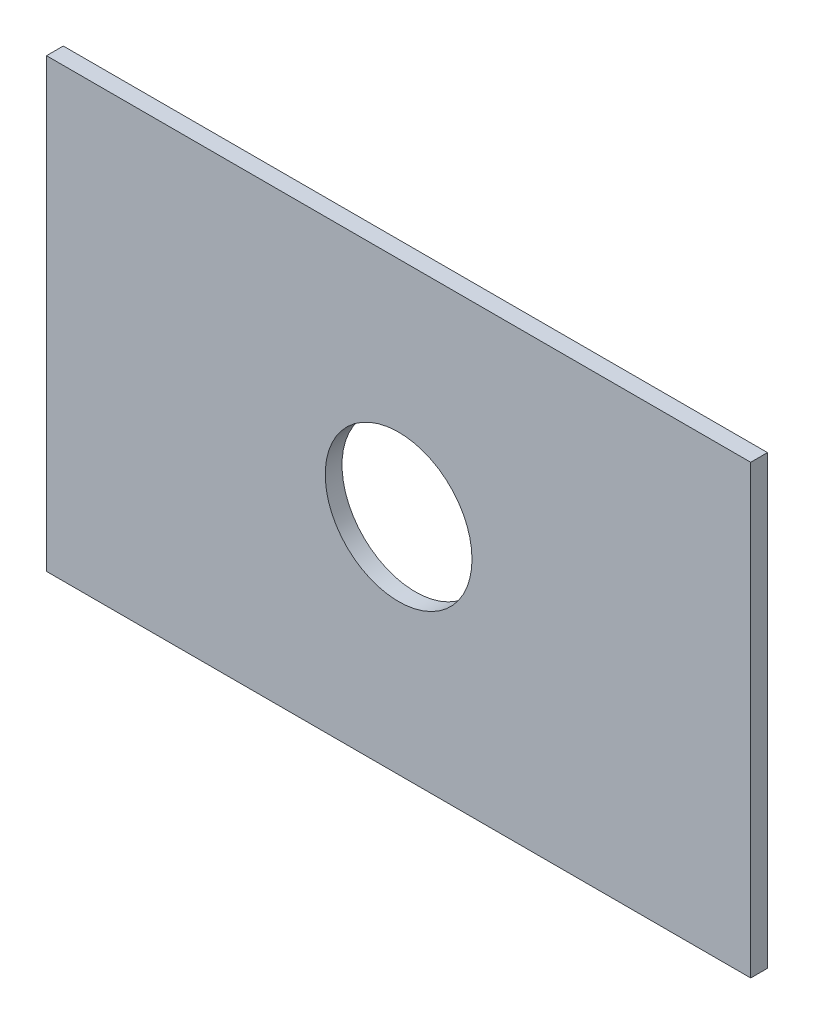
ISO-10303-21;
HEADER;
FILE_DESCRIPTION(('STEP AP214'),'2;1');
FILE_NAME('part.step','',(''),(''),'','','');
FILE_SCHEMA(('AUTOMOTIVE_DESIGN { 1 0 10303 214 1 1 1 1 }'));
ENDSEC;
DATA;
#1=APPLICATION_CONTEXT('core data for automotive mechanical design processes');
#2=APPLICATION_PROTOCOL_DEFINITION('international standard','automotive_design',2000,#1);
#3=PRODUCT_CONTEXT('',#1,'mechanical');
#4=PRODUCT('Part','Part','',(#3));
#5=PRODUCT_RELATED_PRODUCT_CATEGORY('part','',(#4));
#6=PRODUCT_DEFINITION_FORMATION('','',#4);
#7=PRODUCT_DEFINITION_CONTEXT('part definition',#1,'design');
#8=PRODUCT_DEFINITION('design','',#6,#7);
#9=PRODUCT_DEFINITION_SHAPE('','',#8);
#10=(LENGTH_UNIT() NAMED_UNIT(*) SI_UNIT(.MILLI.,.METRE.));
#11=(NAMED_UNIT(*) PLANE_ANGLE_UNIT() SI_UNIT($,.RADIAN.));
#12=(NAMED_UNIT(*) SI_UNIT($,.STERADIAN.) SOLID_ANGLE_UNIT());
#13=UNCERTAINTY_MEASURE_WITH_UNIT(LENGTH_MEASURE(1.E-05),#10,'distance_accuracy_value','');
#14=(GEOMETRIC_REPRESENTATION_CONTEXT(3) GLOBAL_UNCERTAINTY_ASSIGNED_CONTEXT((#13)) GLOBAL_UNIT_ASSIGNED_CONTEXT((#10,
#11,#12)) REPRESENTATION_CONTEXT('',''));
#15=CARTESIAN_POINT('',(0.,0.,0.));
#16=DIRECTION('',(0.,0.,1.));
#17=DIRECTION('',(1.,0.,0.));
#18=AXIS2_PLACEMENT_3D('',#15,#16,#17);
#19=CARTESIAN_POINT('',(0.,0.,2.54));
#20=DIRECTION('',(0.,0.,-1.));
#21=DIRECTION('',(-1.,0.,0.));
#22=AXIS2_PLACEMENT_3D('',#19,#20,#21);
#23=PLANE('',#22);
#24=DIRECTION('',(0.,1.,0.));
#25=VECTOR('',#24,1.);
#26=CARTESIAN_POINT('',(53.3136112878186,-33.8131219822322,2.54));
#27=LINE('',#26,#25);
#28=CARTESIAN_POINT('',(53.3136112878186,-33.8131219822322,2.54));
#29=VERTEX_POINT('',#28);
#30=CARTESIAN_POINT('',(53.3136112878186,33.8131219822322,2.54));
#31=VERTEX_POINT('',#30);
#32=EDGE_CURVE('E92',#29,#31,#27,.T.);
#33=ORIENTED_EDGE('',*,*,#32,.T.);
#34=DIRECTION('',(-1.,0.,0.));
#35=VECTOR('',#34,1.);
#36=CARTESIAN_POINT('',(-53.3136112878186,33.8131219822322,2.54));
#37=LINE('',#36,#35);
#38=CARTESIAN_POINT('',(-53.3136112878186,33.8131219822322,2.54));
#39=VERTEX_POINT('',#38);
#40=EDGE_CURVE('E87',#31,#39,#37,.T.);
#41=ORIENTED_EDGE('',*,*,#40,.T.);
#42=DIRECTION('',(0.,-1.,0.));
#43=VECTOR('',#42,1.);
#44=CARTESIAN_POINT('',(-53.3136112878186,-33.8131219822322,2.54));
#45=LINE('',#44,#43);
#46=CARTESIAN_POINT('',(-53.3136112878186,-33.8131219822322,2.54));
#47=VERTEX_POINT('',#46);
#48=EDGE_CURVE('E90',#39,#47,#45,.T.);
#49=ORIENTED_EDGE('',*,*,#48,.T.);
#50=DIRECTION('',(1.,0.,0.));
#51=VECTOR('',#50,1.);
#52=CARTESIAN_POINT('',(-53.3136112878186,-33.8131219822322,2.54));
#53=LINE('',#52,#51);
#54=EDGE_CURVE('E57',#47,#29,#53,.T.);
#55=ORIENTED_EDGE('',*,*,#54,.T.);
#56=EDGE_LOOP('',(#33,#41,#49,#55));
#57=FACE_BOUND('',#56,.T.);
#58=CARTESIAN_POINT('',(0.,0.,2.54));
#59=DIRECTION('',(0.,0.,1.));
#60=DIRECTION('',(1.,0.,0.));
#61=AXIS2_PLACEMENT_3D('',#58,#59,#60);
#62=CIRCLE('',#61,11.1125);
#63=CARTESIAN_POINT('',(11.1125,0.,2.54));
#64=VERTEX_POINT('',#63);
#65=EDGE_CURVE('E112',#64,#64,#62,.T.);
#66=ORIENTED_EDGE('',*,*,#65,.F.);
#67=EDGE_LOOP('',(#66));
#68=FACE_BOUND('',#67,.T.);
#69=ADVANCED_FACE('F39',(#57,#68),#23,.F.);
#70=CARTESIAN_POINT('',(0.,0.,0.));
#71=DIRECTION('',(0.,0.,-1.));
#72=DIRECTION('',(-1.,0.,0.));
#73=AXIS2_PLACEMENT_3D('',#70,#71,#72);
#74=PLANE('',#73);
#75=DIRECTION('',(0.,1.,0.));
#76=VECTOR('',#75,1.);
#77=CARTESIAN_POINT('',(53.3136112878186,-33.8131219822322,0.));
#78=LINE('',#77,#76);
#79=CARTESIAN_POINT('',(53.3136112878186,-33.8131219822322,0.));
#80=VERTEX_POINT('',#79);
#81=CARTESIAN_POINT('',(53.3136112878186,33.8131219822322,0.));
#82=VERTEX_POINT('',#81);
#83=EDGE_CURVE('E108',#80,#82,#78,.T.);
#84=ORIENTED_EDGE('',*,*,#83,.F.);
#85=DIRECTION('',(1.,0.,0.));
#86=VECTOR('',#85,1.);
#87=CARTESIAN_POINT('',(-53.3136112878186,-33.8131219822322,0.));
#88=LINE('',#87,#86);
#89=CARTESIAN_POINT('',(-53.3136112878186,-33.8131219822322,0.));
#90=VERTEX_POINT('',#89);
#91=EDGE_CURVE('E80',#90,#80,#88,.T.);
#92=ORIENTED_EDGE('',*,*,#91,.F.);
#93=DIRECTION('',(0.,-1.,0.));
#94=VECTOR('',#93,1.);
#95=CARTESIAN_POINT('',(-53.3136112878186,-33.8131219822322,0.));
#96=LINE('',#95,#94);
#97=CARTESIAN_POINT('',(-53.3136112878186,33.8131219822322,0.));
#98=VERTEX_POINT('',#97);
#99=EDGE_CURVE('E74',#98,#90,#96,.T.);
#100=ORIENTED_EDGE('',*,*,#99,.F.);
#101=DIRECTION('',(-1.,0.,0.));
#102=VECTOR('',#101,1.);
#103=CARTESIAN_POINT('',(-53.3136112878186,33.8131219822322,0.));
#104=LINE('',#103,#102);
#105=EDGE_CURVE('E97',#82,#98,#104,.T.);
#106=ORIENTED_EDGE('',*,*,#105,.F.);
#107=EDGE_LOOP('',(#84,#92,#100,#106));
#108=FACE_BOUND('',#107,.T.);
#109=CARTESIAN_POINT('',(0.,0.,0.));
#110=DIRECTION('',(0.,0.,1.));
#111=DIRECTION('',(1.,0.,0.));
#112=AXIS2_PLACEMENT_3D('',#109,#110,#111);
#113=CIRCLE('',#112,11.1125);
#114=CARTESIAN_POINT('',(11.1125,0.,0.));
#115=VERTEX_POINT('',#114);
#116=EDGE_CURVE('E130',#115,#115,#113,.T.);
#117=ORIENTED_EDGE('',*,*,#116,.T.);
#118=EDGE_LOOP('',(#117));
#119=FACE_BOUND('',#118,.T.);
#120=ADVANCED_FACE('F125',(#108,#119),#74,.T.);
#121=CARTESIAN_POINT('',(53.3136112878186,-33.8131219822322,2.54));
#122=DIRECTION('',(-1.,0.,0.));
#123=DIRECTION('',(0.,0.,1.));
#124=AXIS2_PLACEMENT_3D('',#121,#122,#123);
#125=PLANE('',#124);
#126=ORIENTED_EDGE('',*,*,#83,.T.);
#127=DIRECTION('',(0.,0.,-1.));
#128=VECTOR('',#127,1.);
#129=CARTESIAN_POINT('',(53.3136112878186,33.8131219822322,2.54));
#130=LINE('',#129,#128);
#131=EDGE_CURVE('E11',#31,#82,#130,.T.);
#132=ORIENTED_EDGE('',*,*,#131,.F.);
#133=ORIENTED_EDGE('',*,*,#32,.F.);
#134=DIRECTION('',(0.,0.,-1.));
#135=VECTOR('',#134,1.);
#136=CARTESIAN_POINT('',(53.3136112878186,-33.8131219822322,2.54));
#137=LINE('',#136,#135);
#138=EDGE_CURVE('E104',#29,#80,#137,.T.);
#139=ORIENTED_EDGE('',*,*,#138,.T.);
#140=EDGE_LOOP('',(#126,#132,#133,#139));
#141=FACE_BOUND('',#140,.T.);
#142=ADVANCED_FACE('F41',(#141),#125,.F.);
#143=CARTESIAN_POINT('',(-53.3136112878186,33.8131219822322,2.54));
#144=DIRECTION('',(0.,-1.,0.));
#145=DIRECTION('',(0.,0.,-1.));
#146=AXIS2_PLACEMENT_3D('',#143,#144,#145);
#147=PLANE('',#146);
#148=ORIENTED_EDGE('',*,*,#105,.T.);
#149=DIRECTION('',(0.,0.,-1.));
#150=VECTOR('',#149,1.);
#151=CARTESIAN_POINT('',(-53.3136112878186,33.8131219822322,2.54));
#152=LINE('',#151,#150);
#153=EDGE_CURVE('E49',#39,#98,#152,.T.);
#154=ORIENTED_EDGE('',*,*,#153,.F.);
#155=ORIENTED_EDGE('',*,*,#40,.F.);
#156=ORIENTED_EDGE('',*,*,#131,.T.);
#157=EDGE_LOOP('',(#148,#154,#155,#156));
#158=FACE_BOUND('',#157,.T.);
#159=ADVANCED_FACE('F96',(#158),#147,.F.);
#160=CARTESIAN_POINT('',(-53.3136112878186,-33.8131219822322,2.54));
#161=DIRECTION('',(1.,0.,0.));
#162=DIRECTION('',(0.,0.,-1.));
#163=AXIS2_PLACEMENT_3D('',#160,#161,#162);
#164=PLANE('',#163);
#165=ORIENTED_EDGE('',*,*,#99,.T.);
#166=DIRECTION('',(0.,0.,-1.));
#167=VECTOR('',#166,1.);
#168=CARTESIAN_POINT('',(-53.3136112878186,-33.8131219822322,2.54));
#169=LINE('',#168,#167);
#170=EDGE_CURVE('E99',#47,#90,#169,.T.);
#171=ORIENTED_EDGE('',*,*,#170,.F.);
#172=ORIENTED_EDGE('',*,*,#48,.F.);
#173=ORIENTED_EDGE('',*,*,#153,.T.);
#174=EDGE_LOOP('',(#165,#171,#172,#173));
#175=FACE_BOUND('',#174,.T.);
#176=ADVANCED_FACE('F100',(#175),#164,.F.);
#177=CARTESIAN_POINT('',(-53.3136112878186,-33.8131219822322,2.54));
#178=DIRECTION('',(0.,1.,0.));
#179=DIRECTION('',(0.,0.,1.));
#180=AXIS2_PLACEMENT_3D('',#177,#178,#179);
#181=PLANE('',#180);
#182=ORIENTED_EDGE('',*,*,#91,.T.);
#183=ORIENTED_EDGE('',*,*,#138,.F.);
#184=ORIENTED_EDGE('',*,*,#54,.F.);
#185=ORIENTED_EDGE('',*,*,#170,.T.);
#186=EDGE_LOOP('',(#182,#183,#184,#185));
#187=FACE_BOUND('',#186,.T.);
#188=ADVANCED_FACE('F122',(#187),#181,.F.);
#189=CARTESIAN_POINT('',(0.,0.,2.54));
#190=DIRECTION('',(0.,0.,-1.));
#191=DIRECTION('',(-1.,0.,0.));
#192=AXIS2_PLACEMENT_3D('',#189,#190,#191);
#193=CYLINDRICAL_SURFACE('',#192,11.1125);
#194=ORIENTED_EDGE('',*,*,#65,.T.);
#195=EDGE_LOOP('',(#194));
#196=FACE_BOUND('',#195,.T.);
#197=ORIENTED_EDGE('',*,*,#116,.F.);
#198=EDGE_LOOP('',(#197));
#199=FACE_BOUND('',#198,.T.);
#200=ADVANCED_FACE('F138',(#196,#199),#193,.F.);
#201=CLOSED_SHELL('',(#69,#120,#142,#159,#176,#188,#200));
#202=MANIFOLD_SOLID_BREP('B2',#201);
#203=ADVANCED_BREP_SHAPE_REPRESENTATION('',(#18,#202),#14);
#204=SHAPE_DEFINITION_REPRESENTATION(#9,#203);
ENDSEC;
END-ISO-10303-21;
